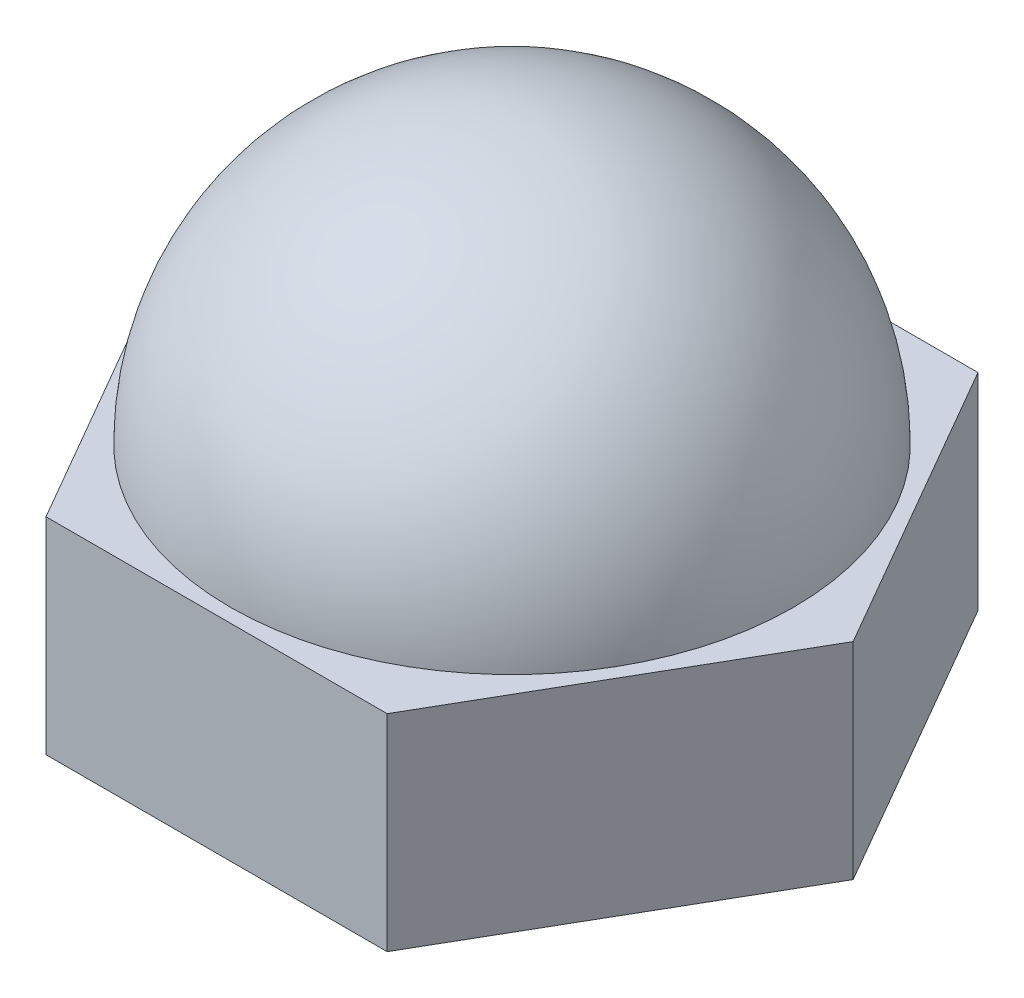
ISO-10303-21;
HEADER;
FILE_DESCRIPTION(('STEP AP214'),'2;1');
FILE_NAME('part.step','',(''),(''),'','','');
FILE_SCHEMA(('AUTOMOTIVE_DESIGN { 1 0 10303 214 1 1 1 1 }'));
ENDSEC;
DATA;
#1=APPLICATION_CONTEXT('core data for automotive mechanical design processes');
#2=APPLICATION_PROTOCOL_DEFINITION('international standard','automotive_design',2000,#1);
#3=PRODUCT_CONTEXT('',#1,'mechanical');
#4=PRODUCT('Part','Part','',(#3));
#5=PRODUCT_RELATED_PRODUCT_CATEGORY('part','',(#4));
#6=PRODUCT_DEFINITION_FORMATION('','',#4);
#7=PRODUCT_DEFINITION_CONTEXT('part definition',#1,'design');
#8=PRODUCT_DEFINITION('design','',#6,#7);
#9=PRODUCT_DEFINITION_SHAPE('','',#8);
#10=(LENGTH_UNIT() NAMED_UNIT(*) SI_UNIT(.MILLI.,.METRE.));
#11=(NAMED_UNIT(*) PLANE_ANGLE_UNIT() SI_UNIT($,.RADIAN.));
#12=(NAMED_UNIT(*) SI_UNIT($,.STERADIAN.) SOLID_ANGLE_UNIT());
#13=UNCERTAINTY_MEASURE_WITH_UNIT(LENGTH_MEASURE(1.E-05),#10,'distance_accuracy_value','');
#14=(GEOMETRIC_REPRESENTATION_CONTEXT(3) GLOBAL_UNCERTAINTY_ASSIGNED_CONTEXT((#13)) GLOBAL_UNIT_ASSIGNED_CONTEXT((#10,
#11,#12)) REPRESENTATION_CONTEXT('',''));
#15=CARTESIAN_POINT('',(0.,0.,0.));
#16=DIRECTION('',(0.,0.,1.));
#17=DIRECTION('',(1.,0.,0.));
#18=AXIS2_PLACEMENT_3D('',#15,#16,#17);
#19=CARTESIAN_POINT('',(0.,3.,0.));
#20=DIRECTION('',(0.,1.,0.));
#21=DIRECTION('',(0.,0.,1.));
#22=AXIS2_PLACEMENT_3D('',#19,#20,#21);
#23=PLANE('',#22);
#24=CARTESIAN_POINT('',(0.,3.,0.));
#25=DIRECTION('',(0.,1.,0.));
#26=DIRECTION('',(0.,0.,1.));
#27=AXIS2_PLACEMENT_3D('',#24,#25,#26);
#28=CIRCLE('',#27,4.1);
#29=CARTESIAN_POINT('',(0.,3.,4.1));
#30=VERTEX_POINT('',#29);
#31=EDGE_CURVE('E11',#30,#30,#28,.T.);
#32=ORIENTED_EDGE('',*,*,#31,.F.);
#33=EDGE_LOOP('',(#32));
#34=FACE_BOUND('',#33,.T.);
#35=DIRECTION('',(0.5,0.,-0.866025403784439));
#36=VECTOR('',#35,1.);
#37=CARTESIAN_POINT('',(2.48260615751539,3.,4.30000000000001));
#38=LINE('',#37,#36);
#39=CARTESIAN_POINT('',(2.48260615751539,3.,4.30000000000001));
#40=VERTEX_POINT('',#39);
#41=CARTESIAN_POINT('',(4.96521231503079,3.,0.));
#42=VERTEX_POINT('',#41);
#43=EDGE_CURVE('E129',#40,#42,#38,.T.);
#44=ORIENTED_EDGE('',*,*,#43,.T.);
#45=DIRECTION('',(-0.5,0.,-0.866025403784439));
#46=VECTOR('',#45,1.);
#47=CARTESIAN_POINT('',(4.96521231503079,3.,0.));
#48=LINE('',#47,#46);
#49=CARTESIAN_POINT('',(2.48260615751539,3.,-4.30000000000002));
#50=VERTEX_POINT('',#49);
#51=EDGE_CURVE('E88',#42,#50,#48,.T.);
#52=ORIENTED_EDGE('',*,*,#51,.T.);
#53=DIRECTION('',(-1.,0.,0.));
#54=VECTOR('',#53,1.);
#55=CARTESIAN_POINT('',(2.48260615751539,3.,-4.30000000000002));
#56=LINE('',#55,#54);
#57=CARTESIAN_POINT('',(-2.4826061575154,3.,-4.30000000000002));
#58=VERTEX_POINT('',#57);
#59=EDGE_CURVE('E100',#50,#58,#56,.T.);
#60=ORIENTED_EDGE('',*,*,#59,.T.);
#61=DIRECTION('',(-0.5,0.,0.866025403784439));
#62=VECTOR('',#61,1.);
#63=CARTESIAN_POINT('',(-2.4826061575154,3.,-4.30000000000002));
#64=LINE('',#63,#62);
#65=CARTESIAN_POINT('',(-4.9652123150308,3.,0.));
#66=VERTEX_POINT('',#65);
#67=EDGE_CURVE('E95',#58,#66,#64,.T.);
#68=ORIENTED_EDGE('',*,*,#67,.T.);
#69=DIRECTION('',(0.5,0.,0.866025403784439));
#70=VECTOR('',#69,1.);
#71=CARTESIAN_POINT('',(-4.9652123150308,3.,0.));
#72=LINE('',#71,#70);
#73=CARTESIAN_POINT('',(-2.4826061575154,3.,4.30000000000001));
#74=VERTEX_POINT('',#73);
#75=EDGE_CURVE('E98',#66,#74,#72,.T.);
#76=ORIENTED_EDGE('',*,*,#75,.T.);
#77=DIRECTION('',(1.,0.,0.));
#78=VECTOR('',#77,1.);
#79=CARTESIAN_POINT('',(-2.4826061575154,3.,4.30000000000001));
#80=LINE('',#79,#78);
#81=EDGE_CURVE('E50',#74,#40,#80,.T.);
#82=ORIENTED_EDGE('',*,*,#81,.T.);
#83=EDGE_LOOP('',(#44,#52,#60,#68,#76,#82));
#84=FACE_BOUND('',#83,.T.);
#85=ADVANCED_FACE('F33',(#34,#84),#23,.T.);
#86=CARTESIAN_POINT('',(0.,0.,0.));
#87=DIRECTION('',(0.,1.,0.));
#88=DIRECTION('',(0.,0.,1.));
#89=AXIS2_PLACEMENT_3D('',#86,#87,#88);
#90=PLANE('',#89);
#91=DIRECTION('',(0.5,0.,-0.866025403784439));
#92=VECTOR('',#91,1.);
#93=CARTESIAN_POINT('',(2.48260615751539,0.,4.30000000000001));
#94=LINE('',#93,#92);
#95=CARTESIAN_POINT('',(2.48260615751539,0.,4.30000000000001));
#96=VERTEX_POINT('',#95);
#97=CARTESIAN_POINT('',(4.96521231503079,0.,0.));
#98=VERTEX_POINT('',#97);
#99=EDGE_CURVE('E118',#96,#98,#94,.T.);
#100=ORIENTED_EDGE('',*,*,#99,.F.);
#101=DIRECTION('',(1.,0.,0.));
#102=VECTOR('',#101,1.);
#103=CARTESIAN_POINT('',(-2.4826061575154,0.,4.30000000000001));
#104=LINE('',#103,#102);
#105=CARTESIAN_POINT('',(-2.4826061575154,0.,4.30000000000001));
#106=VERTEX_POINT('',#105);
#107=EDGE_CURVE('E79',#106,#96,#104,.T.);
#108=ORIENTED_EDGE('',*,*,#107,.F.);
#109=DIRECTION('',(0.5,0.,0.866025403784439));
#110=VECTOR('',#109,1.);
#111=CARTESIAN_POINT('',(-4.9652123150308,0.,0.));
#112=LINE('',#111,#110);
#113=CARTESIAN_POINT('',(-4.9652123150308,0.,0.));
#114=VERTEX_POINT('',#113);
#115=EDGE_CURVE('E73',#114,#106,#112,.T.);
#116=ORIENTED_EDGE('',*,*,#115,.F.);
#117=DIRECTION('',(-0.5,0.,0.866025403784439));
#118=VECTOR('',#117,1.);
#119=CARTESIAN_POINT('',(-2.4826061575154,0.,-4.30000000000002));
#120=LINE('',#119,#118);
#121=CARTESIAN_POINT('',(-2.4826061575154,0.,-4.30000000000002));
#122=VERTEX_POINT('',#121);
#123=EDGE_CURVE('E108',#122,#114,#120,.T.);
#124=ORIENTED_EDGE('',*,*,#123,.F.);
#125=DIRECTION('',(-1.,0.,0.));
#126=VECTOR('',#125,1.);
#127=CARTESIAN_POINT('',(2.48260615751539,0.,-4.30000000000002));
#128=LINE('',#127,#126);
#129=CARTESIAN_POINT('',(2.48260615751539,0.,-4.30000000000002));
#130=VERTEX_POINT('',#129);
#131=EDGE_CURVE('E124',#130,#122,#128,.T.);
#132=ORIENTED_EDGE('',*,*,#131,.F.);
#133=DIRECTION('',(-0.5,0.,-0.866025403784439));
#134=VECTOR('',#133,1.);
#135=CARTESIAN_POINT('',(4.96521231503079,0.,0.));
#136=LINE('',#135,#134);
#137=EDGE_CURVE('E121',#98,#130,#136,.T.);
#138=ORIENTED_EDGE('',*,*,#137,.F.);
#139=EDGE_LOOP('',(#100,#108,#116,#124,#132,#138));
#140=FACE_BOUND('',#139,.T.);
#141=CARTESIAN_POINT('',(0.,0.,0.));
#142=DIRECTION('',(0.,1.,0.));
#143=DIRECTION('',(0.,0.,1.));
#144=AXIS2_PLACEMENT_3D('',#141,#142,#143);
#145=CIRCLE('',#144,4.);
#146=CARTESIAN_POINT('',(0.,0.,4.));
#147=VERTEX_POINT('',#146);
#148=EDGE_CURVE('E122',#147,#147,#145,.T.);
#149=ORIENTED_EDGE('',*,*,#148,.T.);
#150=EDGE_LOOP('',(#149));
#151=FACE_BOUND('',#150,.T.);
#152=ADVANCED_FACE('F141',(#140,#151),#90,.F.);
#153=CARTESIAN_POINT('',(2.48260615751539,3.,4.30000000000001));
#154=DIRECTION('',(-0.866025403784438,0.,-0.5));
#155=DIRECTION('',(-0.5,0.,0.866025403784439));
#156=AXIS2_PLACEMENT_3D('',#153,#154,#155);
#157=PLANE('',#156);
#158=ORIENTED_EDGE('',*,*,#99,.T.);
#159=DIRECTION('',(0.,-1.,0.));
#160=VECTOR('',#159,1.);
#161=CARTESIAN_POINT('',(4.96521231503079,3.,0.));
#162=LINE('',#161,#160);
#163=EDGE_CURVE('E42',#42,#98,#162,.T.);
#164=ORIENTED_EDGE('',*,*,#163,.F.);
#165=ORIENTED_EDGE('',*,*,#43,.F.);
#166=DIRECTION('',(0.,-1.,0.));
#167=VECTOR('',#166,1.);
#168=CARTESIAN_POINT('',(2.48260615751539,3.,4.30000000000001));
#169=LINE('',#168,#167);
#170=EDGE_CURVE('E114',#40,#96,#169,.T.);
#171=ORIENTED_EDGE('',*,*,#170,.T.);
#172=EDGE_LOOP('',(#158,#164,#165,#171));
#173=FACE_BOUND('',#172,.T.);
#174=ADVANCED_FACE('F35',(#173),#157,.F.);
#175=CARTESIAN_POINT('',(4.96521231503079,3.,0.));
#176=DIRECTION('',(-0.866025403784439,0.,0.5));
#177=DIRECTION('',(0.5,0.,0.866025403784439));
#178=AXIS2_PLACEMENT_3D('',#175,#176,#177);
#179=PLANE('',#178);
#180=ORIENTED_EDGE('',*,*,#137,.T.);
#181=DIRECTION('',(0.,-1.,0.));
#182=VECTOR('',#181,1.);
#183=CARTESIAN_POINT('',(2.48260615751539,3.,-4.30000000000002));
#184=LINE('',#183,#182);
#185=EDGE_CURVE('E133',#50,#130,#184,.T.);
#186=ORIENTED_EDGE('',*,*,#185,.F.);
#187=ORIENTED_EDGE('',*,*,#51,.F.);
#188=ORIENTED_EDGE('',*,*,#163,.T.);
#189=EDGE_LOOP('',(#180,#186,#187,#188));
#190=FACE_BOUND('',#189,.T.);
#191=ADVANCED_FACE('F136',(#190),#179,.F.);
#192=CARTESIAN_POINT('',(2.48260615751539,3.,-4.30000000000002));
#193=DIRECTION('',(0.,0.,1.));
#194=DIRECTION('',(1.,0.,0.));
#195=AXIS2_PLACEMENT_3D('',#192,#193,#194);
#196=PLANE('',#195);
#197=ORIENTED_EDGE('',*,*,#131,.T.);
#198=DIRECTION('',(0.,-1.,0.));
#199=VECTOR('',#198,1.);
#200=CARTESIAN_POINT('',(-2.4826061575154,3.,-4.30000000000002));
#201=LINE('',#200,#199);
#202=EDGE_CURVE('E109',#58,#122,#201,.T.);
#203=ORIENTED_EDGE('',*,*,#202,.F.);
#204=ORIENTED_EDGE('',*,*,#59,.F.);
#205=ORIENTED_EDGE('',*,*,#185,.T.);
#206=EDGE_LOOP('',(#197,#203,#204,#205));
#207=FACE_BOUND('',#206,.T.);
#208=ADVANCED_FACE('F145',(#207),#196,.F.);
#209=CARTESIAN_POINT('',(-2.4826061575154,3.,-4.30000000000002));
#210=DIRECTION('',(0.866025403784439,0.,0.5));
#211=DIRECTION('',(0.5,0.,-0.866025403784439));
#212=AXIS2_PLACEMENT_3D('',#209,#210,#211);
#213=PLANE('',#212);
#214=ORIENTED_EDGE('',*,*,#123,.T.);
#215=DIRECTION('',(0.,-1.,0.));
#216=VECTOR('',#215,1.);
#217=CARTESIAN_POINT('',(-4.9652123150308,3.,0.));
#218=LINE('',#217,#216);
#219=EDGE_CURVE('E105',#66,#114,#218,.T.);
#220=ORIENTED_EDGE('',*,*,#219,.F.);
#221=ORIENTED_EDGE('',*,*,#67,.F.);
#222=ORIENTED_EDGE('',*,*,#202,.T.);
#223=EDGE_LOOP('',(#214,#220,#221,#222));
#224=FACE_BOUND('',#223,.T.);
#225=ADVANCED_FACE('F106',(#224),#213,.F.);
#226=CARTESIAN_POINT('',(-4.9652123150308,3.,0.));
#227=DIRECTION('',(0.866025403784438,0.,-0.5));
#228=DIRECTION('',(-0.5,0.,-0.866025403784439));
#229=AXIS2_PLACEMENT_3D('',#226,#227,#228);
#230=PLANE('',#229);
#231=ORIENTED_EDGE('',*,*,#115,.T.);
#232=DIRECTION('',(0.,-1.,0.));
#233=VECTOR('',#232,1.);
#234=CARTESIAN_POINT('',(-2.4826061575154,3.,4.30000000000001));
#235=LINE('',#234,#233);
#236=EDGE_CURVE('E110',#74,#106,#235,.T.);
#237=ORIENTED_EDGE('',*,*,#236,.F.);
#238=ORIENTED_EDGE('',*,*,#75,.F.);
#239=ORIENTED_EDGE('',*,*,#219,.T.);
#240=EDGE_LOOP('',(#231,#237,#238,#239));
#241=FACE_BOUND('',#240,.T.);
#242=ADVANCED_FACE('F112',(#241),#230,.F.);
#243=CARTESIAN_POINT('',(-2.4826061575154,3.,4.30000000000001));
#244=DIRECTION('',(0.,0.,-1.));
#245=DIRECTION('',(-1.,0.,0.));
#246=AXIS2_PLACEMENT_3D('',#243,#244,#245);
#247=PLANE('',#246);
#248=ORIENTED_EDGE('',*,*,#107,.T.);
#249=ORIENTED_EDGE('',*,*,#170,.F.);
#250=ORIENTED_EDGE('',*,*,#81,.F.);
#251=ORIENTED_EDGE('',*,*,#236,.T.);
#252=EDGE_LOOP('',(#248,#249,#250,#251));
#253=FACE_BOUND('',#252,.T.);
#254=ADVANCED_FACE('F177',(#253),#247,.F.);
#255=CARTESIAN_POINT('',(0.,3.,0.));
#256=DIRECTION('',(0.,-1.,0.));
#257=DIRECTION('',(0.,0.,-1.));
#258=AXIS2_PLACEMENT_3D('',#255,#256,#257);
#259=CYLINDRICAL_SURFACE('',#258,4.);
#260=CARTESIAN_POINT('',(0.,3.,0.));
#261=DIRECTION('',(0.,-1.,0.));
#262=DIRECTION('',(0.,0.,-1.));
#263=AXIS2_PLACEMENT_3D('',#260,#261,#262);
#264=CIRCLE('',#263,4.);
#265=CARTESIAN_POINT('',(0.,3.,-4.));
#266=VERTEX_POINT('',#265);
#267=EDGE_CURVE('E151',#266,#266,#264,.T.);
#268=ORIENTED_EDGE('',*,*,#267,.F.);
#269=EDGE_LOOP('',(#268));
#270=FACE_BOUND('',#269,.T.);
#271=ORIENTED_EDGE('',*,*,#148,.F.);
#272=EDGE_LOOP('',(#271));
#273=FACE_BOUND('',#272,.T.);
#274=ADVANCED_FACE('F173',(#270,#273),#259,.F.);
#275=CARTESIAN_POINT('',(4.1,3.,0.));
#276=DIRECTION('',(0.,-1.,0.));
#277=DIRECTION('',(0.,0.,-1.));
#278=AXIS2_PLACEMENT_3D('',#275,#276,#277);
#279=PLANE('',#278);
#280=ORIENTED_EDGE('',*,*,#267,.T.);
#281=EDGE_LOOP('',(#280));
#282=FACE_BOUND('',#281,.T.);
#283=ADVANCED_FACE('F176',(#282),#279,.T.);
#284=CARTESIAN_POINT('',(0.,3.,0.));
#285=DIRECTION('',(0.,1.,0.));
#286=DIRECTION('',(1.,0.,0.));
#287=AXIS2_PLACEMENT_3D('',#284,#285,#286);
#288=SPHERICAL_SURFACE('',#287,4.1);
#289=ORIENTED_EDGE('',*,*,#31,.T.);
#290=EDGE_LOOP('',(#289));
#291=FACE_BOUND('',#290,.T.);
#292=ADVANCED_FACE('F170',(#291),#288,.T.);
#293=CLOSED_SHELL('',(#85,#152,#174,#191,#208,#225,#242,#254,#274,#283,#292));
#294=CARTESIAN_POINT('',(4.1,4.,0.));
#295=DIRECTION('',(0.,-1.,0.));
#296=DIRECTION('',(0.,0.,-1.));
#297=AXIS2_PLACEMENT_3D('',#294,#295,#296);
#298=PLANE('',#297);
#299=CARTESIAN_POINT('',(0.,4.,0.));
#300=DIRECTION('',(0.,1.,0.));
#301=DIRECTION('',(0.,0.,1.));
#302=AXIS2_PLACEMENT_3D('',#299,#300,#301);
#303=CIRCLE('',#302,2.93428015022424);
#304=CARTESIAN_POINT('',(0.,4.,2.93428015022424));
#305=VERTEX_POINT('',#304);
#306=EDGE_CURVE('E154',#305,#305,#303,.T.);
#307=ORIENTED_EDGE('',*,*,#306,.T.);
#308=EDGE_LOOP('',(#307));
#309=FACE_BOUND('',#308,.T.);
#310=ADVANCED_FACE('F158',(#309),#298,.F.);
#311=CARTESIAN_POINT('',(0.,3.,0.));
#312=DIRECTION('',(0.,1.,0.));
#313=DIRECTION('',(1.,0.,0.));
#314=AXIS2_PLACEMENT_3D('',#311,#312,#313);
#315=SPHERICAL_SURFACE('',#314,3.1);
#316=ORIENTED_EDGE('',*,*,#306,.F.);
#317=EDGE_LOOP('',(#316));
#318=FACE_BOUND('',#317,.T.);
#319=ADVANCED_FACE('F160',(#318),#315,.F.);
#320=CLOSED_SHELL('',(#310,#319));
#321=ORIENTED_CLOSED_SHELL('',*,#320,.T.);
#322=BREP_WITH_VOIDS('B2',#293,(#321));
#323=ADVANCED_BREP_SHAPE_REPRESENTATION('',(#18,#322),#14);
#324=SHAPE_DEFINITION_REPRESENTATION(#9,#323);
ENDSEC;
END-ISO-10303-21;
